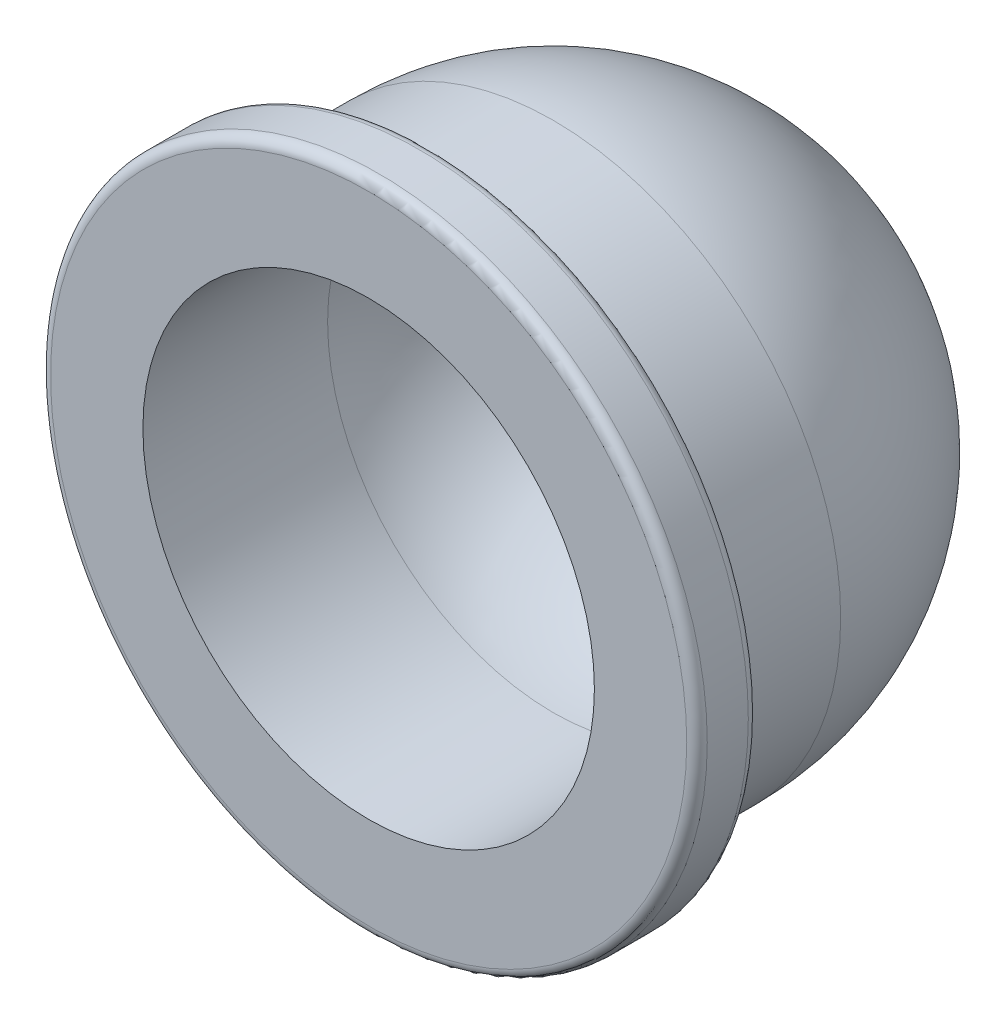
ISO-10303-21;
HEADER;
FILE_DESCRIPTION(('STEP AP214'),'2;1');
FILE_NAME('part.step','',(''),(''),'','','');
FILE_SCHEMA(('AUTOMOTIVE_DESIGN { 1 0 10303 214 1 1 1 1 }'));
ENDSEC;
DATA;
#1=APPLICATION_CONTEXT('core data for automotive mechanical design processes');
#2=APPLICATION_PROTOCOL_DEFINITION('international standard','automotive_design',2000,#1);
#3=PRODUCT_CONTEXT('',#1,'mechanical');
#4=PRODUCT('Part','Part','',(#3));
#5=PRODUCT_RELATED_PRODUCT_CATEGORY('part','',(#4));
#6=PRODUCT_DEFINITION_FORMATION('','',#4);
#7=PRODUCT_DEFINITION_CONTEXT('part definition',#1,'design');
#8=PRODUCT_DEFINITION('design','',#6,#7);
#9=PRODUCT_DEFINITION_SHAPE('','',#8);
#10=(LENGTH_UNIT() NAMED_UNIT(*) SI_UNIT(.MILLI.,.METRE.));
#11=(NAMED_UNIT(*) PLANE_ANGLE_UNIT() SI_UNIT($,.RADIAN.));
#12=(NAMED_UNIT(*) SI_UNIT($,.STERADIAN.) SOLID_ANGLE_UNIT());
#13=UNCERTAINTY_MEASURE_WITH_UNIT(LENGTH_MEASURE(1.E-05),#10,'distance_accuracy_value','');
#14=(GEOMETRIC_REPRESENTATION_CONTEXT(3) GLOBAL_UNCERTAINTY_ASSIGNED_CONTEXT((#13)) GLOBAL_UNIT_ASSIGNED_CONTEXT((#10,
#11,#12)) REPRESENTATION_CONTEXT('',''));
#15=CARTESIAN_POINT('',(0.,0.,0.));
#16=DIRECTION('',(0.,0.,1.));
#17=DIRECTION('',(1.,0.,0.));
#18=AXIS2_PLACEMENT_3D('',#15,#16,#17);
#19=CARTESIAN_POINT('',(0.,0.,10.));
#20=DIRECTION('',(0.,0.,-1.));
#21=DIRECTION('',(-1.,0.,0.));
#22=AXIS2_PLACEMENT_3D('',#19,#20,#21);
#23=CYLINDRICAL_SURFACE('',#22,7.);
#24=CARTESIAN_POINT('',(0.,0.,7.));
#25=DIRECTION('',(0.,0.,-1.));
#26=DIRECTION('',(-1.,0.,0.));
#27=AXIS2_PLACEMENT_3D('',#24,#25,#26);
#28=CIRCLE('',#27,7.);
#29=CARTESIAN_POINT('',(-7.,0.,7.));
#30=VERTEX_POINT('',#29);
#31=EDGE_CURVE('E61',#30,#30,#28,.F.);
#32=ORIENTED_EDGE('',*,*,#31,.T.);
#33=EDGE_LOOP('',(#32));
#34=FACE_BOUND('',#33,.T.);
#35=CARTESIAN_POINT('',(0.,0.,10.));
#36=DIRECTION('',(0.,0.,1.));
#37=DIRECTION('',(1.,0.,0.));
#38=AXIS2_PLACEMENT_3D('',#35,#36,#37);
#39=CIRCLE('',#38,7.);
#40=CARTESIAN_POINT('',(7.,0.,10.));
#41=VERTEX_POINT('',#40);
#42=EDGE_CURVE('E65',#41,#41,#39,.T.);
#43=ORIENTED_EDGE('',*,*,#42,.F.);
#44=EDGE_LOOP('',(#43));
#45=FACE_BOUND('',#44,.T.);
#46=ADVANCED_FACE('F37',(#34,#45),#23,.T.);
#47=CARTESIAN_POINT('',(0.,0.,11.5));
#48=DIRECTION('',(0.,0.,-1.));
#49=DIRECTION('',(-1.,0.,0.));
#50=AXIS2_PLACEMENT_3D('',#47,#48,#49);
#51=CYLINDRICAL_SURFACE('',#50,8.);
#52=CARTESIAN_POINT('',(0.,0.,10.25));
#53=DIRECTION('',(0.,0.,1.));
#54=DIRECTION('',(1.,0.,0.));
#55=AXIS2_PLACEMENT_3D('',#52,#53,#54);
#56=CIRCLE('',#55,8.);
#57=CARTESIAN_POINT('',(8.,0.,10.25));
#58=VERTEX_POINT('',#57);
#59=EDGE_CURVE('E50',#58,#58,#56,.T.);
#60=ORIENTED_EDGE('',*,*,#59,.T.);
#61=EDGE_LOOP('',(#60));
#62=FACE_BOUND('',#61,.T.);
#63=CARTESIAN_POINT('',(0.,0.,11.25));
#64=DIRECTION('',(0.,0.,1.));
#65=DIRECTION('',(1.,0.,0.));
#66=AXIS2_PLACEMENT_3D('',#63,#64,#65);
#67=CIRCLE('',#66,8.);
#68=CARTESIAN_POINT('',(8.,0.,11.25));
#69=VERTEX_POINT('',#68);
#70=EDGE_CURVE('E55',#69,#69,#67,.F.);
#71=ORIENTED_EDGE('',*,*,#70,.T.);
#72=EDGE_LOOP('',(#71));
#73=FACE_BOUND('',#72,.T.);
#74=ADVANCED_FACE('F90',(#62,#73),#51,.T.);
#75=CARTESIAN_POINT('',(0.,0.,11.5));
#76=DIRECTION('',(0.,0.,1.));
#77=DIRECTION('',(1.,0.,0.));
#78=AXIS2_PLACEMENT_3D('',#75,#76,#77);
#79=PLANE('',#78);
#80=CARTESIAN_POINT('',(0.,0.,11.5));
#81=DIRECTION('',(0.,0.,1.));
#82=DIRECTION('',(1.,0.,0.));
#83=AXIS2_PLACEMENT_3D('',#80,#81,#82);
#84=CIRCLE('',#83,7.75);
#85=CARTESIAN_POINT('',(7.75,0.,11.5));
#86=VERTEX_POINT('',#85);
#87=EDGE_CURVE('E10',#86,#86,#84,.T.);
#88=ORIENTED_EDGE('',*,*,#87,.T.);
#89=EDGE_LOOP('',(#88));
#90=FACE_BOUND('',#89,.T.);
#91=CARTESIAN_POINT('',(0.,0.,11.5));
#92=DIRECTION('',(0.,0.,1.));
#93=DIRECTION('',(1.,0.,0.));
#94=AXIS2_PLACEMENT_3D('',#91,#92,#93);
#95=CIRCLE('',#94,5.5);
#96=CARTESIAN_POINT('',(5.5,0.,11.5));
#97=VERTEX_POINT('',#96);
#98=EDGE_CURVE('E70',#97,#97,#95,.T.);
#99=ORIENTED_EDGE('',*,*,#98,.F.);
#100=EDGE_LOOP('',(#99));
#101=FACE_BOUND('',#100,.T.);
#102=ADVANCED_FACE('F87',(#90,#101),#79,.T.);
#103=CARTESIAN_POINT('',(0.,0.,10.));
#104=DIRECTION('',(0.,0.,1.));
#105=DIRECTION('',(1.,0.,0.));
#106=AXIS2_PLACEMENT_3D('',#103,#104,#105);
#107=PLANE('',#106);
#108=CARTESIAN_POINT('',(0.,0.,10.));
#109=DIRECTION('',(0.,0.,1.));
#110=DIRECTION('',(1.,0.,0.));
#111=AXIS2_PLACEMENT_3D('',#108,#109,#110);
#112=CIRCLE('',#111,7.75);
#113=CARTESIAN_POINT('',(7.75,0.,10.));
#114=VERTEX_POINT('',#113);
#115=EDGE_CURVE('E45',#114,#114,#112,.F.);
#116=ORIENTED_EDGE('',*,*,#115,.T.);
#117=EDGE_LOOP('',(#116));
#118=FACE_BOUND('',#117,.T.);
#119=ORIENTED_EDGE('',*,*,#42,.T.);
#120=EDGE_LOOP('',(#119));
#121=FACE_BOUND('',#120,.T.);
#122=ADVANCED_FACE('F89',(#118,#121),#107,.F.);
#123=CARTESIAN_POINT('',(0.,0.,7.));
#124=DIRECTION('',(0.,0.,1.));
#125=DIRECTION('',(1.,0.,0.));
#126=AXIS2_PLACEMENT_3D('',#123,#124,#125);
#127=SPHERICAL_SURFACE('',#126,7.);
#128=ORIENTED_EDGE('',*,*,#31,.F.);
#129=EDGE_LOOP('',(#128));
#130=FACE_BOUND('',#129,.T.);
#131=ADVANCED_FACE('F83',(#130),#127,.T.);
#132=CARTESIAN_POINT('',(0.,0.,10.));
#133=DIRECTION('',(0.,0.,-1.));
#134=DIRECTION('',(-1.,0.,0.));
#135=AXIS2_PLACEMENT_3D('',#132,#133,#134);
#136=CYLINDRICAL_SURFACE('',#135,5.5);
#137=CARTESIAN_POINT('',(0.,0.,7.));
#138=DIRECTION('',(0.,0.,-1.));
#139=DIRECTION('',(-1.,0.,0.));
#140=AXIS2_PLACEMENT_3D('',#137,#138,#139);
#141=CIRCLE('',#140,5.5);
#142=CARTESIAN_POINT('',(-5.5,0.,7.));
#143=VERTEX_POINT('',#142);
#144=EDGE_CURVE('E69',#143,#143,#141,.F.);
#145=ORIENTED_EDGE('',*,*,#144,.F.);
#146=EDGE_LOOP('',(#145));
#147=FACE_BOUND('',#146,.T.);
#148=ORIENTED_EDGE('',*,*,#98,.T.);
#149=EDGE_LOOP('',(#148));
#150=FACE_BOUND('',#149,.T.);
#151=ADVANCED_FACE('F80',(#147,#150),#136,.F.);
#152=CARTESIAN_POINT('',(0.,0.,7.));
#153=DIRECTION('',(0.,0.,1.));
#154=DIRECTION('',(1.,0.,0.));
#155=AXIS2_PLACEMENT_3D('',#152,#153,#154);
#156=SPHERICAL_SURFACE('',#155,5.5);
#157=ORIENTED_EDGE('',*,*,#144,.T.);
#158=EDGE_LOOP('',(#157));
#159=FACE_BOUND('',#158,.T.);
#160=ADVANCED_FACE('F78',(#159),#156,.F.);
#161=CARTESIAN_POINT('',(0.,0.,10.25));
#162=DIRECTION('',(0.,0.,1.));
#163=DIRECTION('',(1.,0.,0.));
#164=AXIS2_PLACEMENT_3D('',#161,#162,#163);
#165=TOROIDAL_SURFACE('',#164,7.75,0.25);
#166=ORIENTED_EDGE('',*,*,#115,.F.);
#167=EDGE_LOOP('',(#166));
#168=FACE_BOUND('',#167,.T.);
#169=ORIENTED_EDGE('',*,*,#59,.F.);
#170=EDGE_LOOP('',(#169));
#171=FACE_BOUND('',#170,.T.);
#172=ADVANCED_FACE('F109',(#168,#171),#165,.T.);
#173=CARTESIAN_POINT('',(0.,0.,11.25));
#174=DIRECTION('',(0.,0.,1.));
#175=DIRECTION('',(1.,0.,0.));
#176=AXIS2_PLACEMENT_3D('',#173,#174,#175);
#177=TOROIDAL_SURFACE('',#176,7.75,0.25);
#178=ORIENTED_EDGE('',*,*,#70,.F.);
#179=EDGE_LOOP('',(#178));
#180=FACE_BOUND('',#179,.T.);
#181=ORIENTED_EDGE('',*,*,#87,.F.);
#182=EDGE_LOOP('',(#181));
#183=FACE_BOUND('',#182,.T.);
#184=ADVANCED_FACE('F39',(#180,#183),#177,.T.);
#185=CLOSED_SHELL('',(#46,#74,#102,#122,#131,#151,#160,#172,#184));
#186=MANIFOLD_SOLID_BREP('B2',#185);
#187=ADVANCED_BREP_SHAPE_REPRESENTATION('',(#18,#186),#14);
#188=SHAPE_DEFINITION_REPRESENTATION(#9,#187);
ENDSEC;
END-ISO-10303-21;
